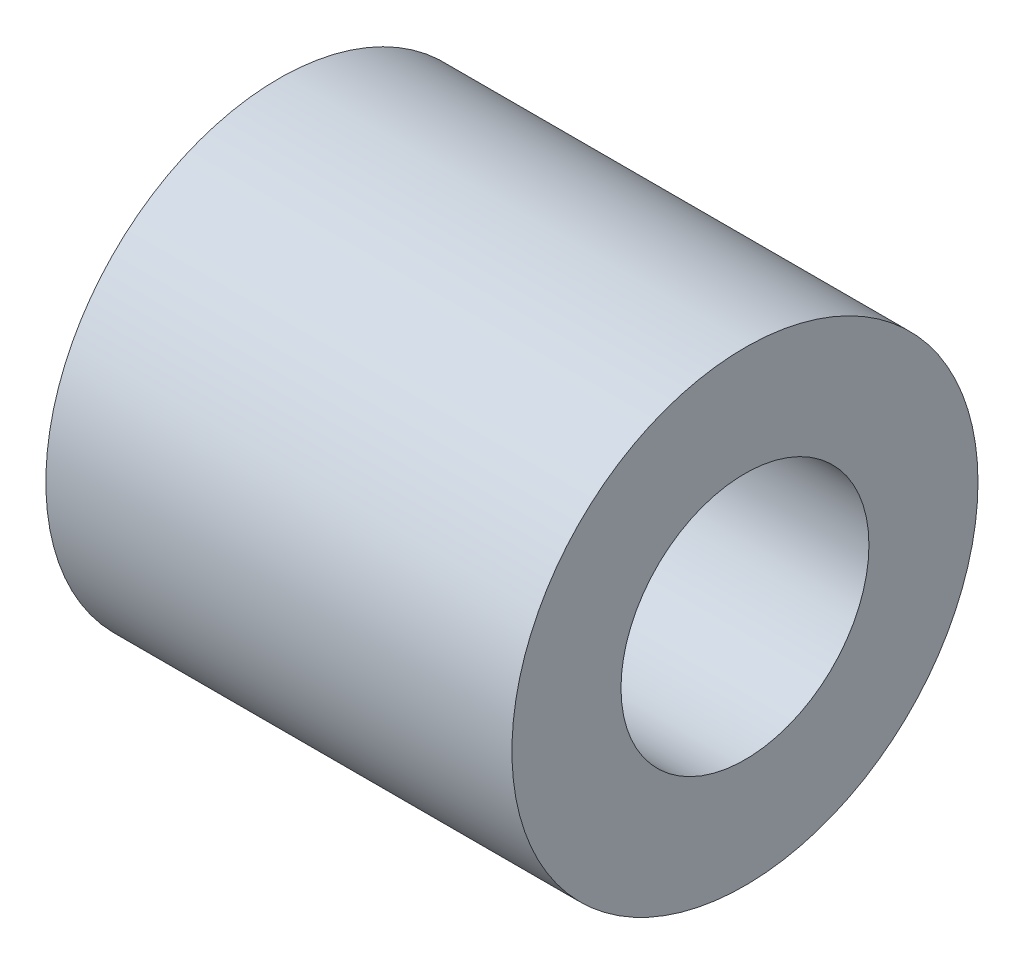
ISO-10303-21;
HEADER;
FILE_DESCRIPTION(('STEP AP214'),'2;1');
FILE_NAME('part.step','',(''),(''),'','','');
FILE_SCHEMA(('AUTOMOTIVE_DESIGN { 1 0 10303 214 1 1 1 1 }'));
ENDSEC;
DATA;
#1=APPLICATION_CONTEXT('core data for automotive mechanical design processes');
#2=APPLICATION_PROTOCOL_DEFINITION('international standard','automotive_design',2000,#1);
#3=PRODUCT_CONTEXT('',#1,'mechanical');
#4=PRODUCT('Part','Part','',(#3));
#5=PRODUCT_RELATED_PRODUCT_CATEGORY('part','',(#4));
#6=PRODUCT_DEFINITION_FORMATION('','',#4);
#7=PRODUCT_DEFINITION_CONTEXT('part definition',#1,'design');
#8=PRODUCT_DEFINITION('design','',#6,#7);
#9=PRODUCT_DEFINITION_SHAPE('','',#8);
#10=(LENGTH_UNIT() NAMED_UNIT(*) SI_UNIT(.MILLI.,.METRE.));
#11=(NAMED_UNIT(*) PLANE_ANGLE_UNIT() SI_UNIT($,.RADIAN.));
#12=(NAMED_UNIT(*) SI_UNIT($,.STERADIAN.) SOLID_ANGLE_UNIT());
#13=UNCERTAINTY_MEASURE_WITH_UNIT(LENGTH_MEASURE(1.E-05),#10,'distance_accuracy_value','');
#14=(GEOMETRIC_REPRESENTATION_CONTEXT(3) GLOBAL_UNCERTAINTY_ASSIGNED_CONTEXT((#13)) GLOBAL_UNIT_ASSIGNED_CONTEXT((#10,
#11,#12)) REPRESENTATION_CONTEXT('',''));
#15=CARTESIAN_POINT('',(0.,0.,0.));
#16=DIRECTION('',(0.,0.,1.));
#17=DIRECTION('',(1.,0.,0.));
#18=AXIS2_PLACEMENT_3D('',#15,#16,#17);
#19=CARTESIAN_POINT('',(12.7,0.,0.));
#20=DIRECTION('',(1.,0.,0.));
#21=DIRECTION('',(0.,0.,-1.));
#22=AXIS2_PLACEMENT_3D('',#19,#20,#21);
#23=PLANE('',#22);
#24=CARTESIAN_POINT('',(12.7,0.,0.));
#25=DIRECTION('',(1.,0.,0.));
#26=DIRECTION('',(0.,0.,-1.));
#27=AXIS2_PLACEMENT_3D('',#24,#25,#26);
#28=CIRCLE('',#27,6.35);
#29=CARTESIAN_POINT('',(12.7,0.,-6.35));
#30=VERTEX_POINT('',#29);
#31=EDGE_CURVE('E10',#30,#30,#28,.T.);
#32=ORIENTED_EDGE('',*,*,#31,.T.);
#33=EDGE_LOOP('',(#32));
#34=FACE_BOUND('',#33,.T.);
#35=CARTESIAN_POINT('',(12.7,0.,0.));
#36=DIRECTION('',(1.,0.,0.));
#37=DIRECTION('',(0.,0.,-1.));
#38=AXIS2_PLACEMENT_3D('',#35,#36,#37);
#39=CIRCLE('',#38,3.3782);
#40=CARTESIAN_POINT('',(12.7,0.,-3.3782));
#41=VERTEX_POINT('',#40);
#42=EDGE_CURVE('E41',#41,#41,#39,.T.);
#43=ORIENTED_EDGE('',*,*,#42,.F.);
#44=EDGE_LOOP('',(#43));
#45=FACE_BOUND('',#44,.T.);
#46=ADVANCED_FACE('F30',(#34,#45),#23,.T.);
#47=CARTESIAN_POINT('',(0.,0.,0.));
#48=DIRECTION('',(1.,0.,0.));
#49=DIRECTION('',(0.,0.,-1.));
#50=AXIS2_PLACEMENT_3D('',#47,#48,#49);
#51=PLANE('',#50);
#52=CARTESIAN_POINT('',(0.,0.,0.));
#53=DIRECTION('',(1.,0.,0.));
#54=DIRECTION('',(0.,0.,-1.));
#55=AXIS2_PLACEMENT_3D('',#52,#53,#54);
#56=CIRCLE('',#55,6.35);
#57=CARTESIAN_POINT('',(0.,0.,-6.35));
#58=VERTEX_POINT('',#57);
#59=EDGE_CURVE('E34',#58,#58,#56,.T.);
#60=ORIENTED_EDGE('',*,*,#59,.F.);
#61=EDGE_LOOP('',(#60));
#62=FACE_BOUND('',#61,.T.);
#63=CARTESIAN_POINT('',(0.,0.,0.));
#64=DIRECTION('',(1.,0.,0.));
#65=DIRECTION('',(0.,0.,-1.));
#66=AXIS2_PLACEMENT_3D('',#63,#64,#65);
#67=CIRCLE('',#66,3.3782);
#68=CARTESIAN_POINT('',(0.,0.,-3.3782));
#69=VERTEX_POINT('',#68);
#70=EDGE_CURVE('E43',#69,#69,#67,.T.);
#71=ORIENTED_EDGE('',*,*,#70,.T.);
#72=EDGE_LOOP('',(#71));
#73=FACE_BOUND('',#72,.T.);
#74=ADVANCED_FACE('F53',(#62,#73),#51,.F.);
#75=CARTESIAN_POINT('',(12.7,0.,0.));
#76=DIRECTION('',(-1.,0.,0.));
#77=DIRECTION('',(0.,0.,1.));
#78=AXIS2_PLACEMENT_3D('',#75,#76,#77);
#79=CYLINDRICAL_SURFACE('',#78,6.35);
#80=ORIENTED_EDGE('',*,*,#31,.F.);
#81=EDGE_LOOP('',(#80));
#82=FACE_BOUND('',#81,.T.);
#83=ORIENTED_EDGE('',*,*,#59,.T.);
#84=EDGE_LOOP('',(#83));
#85=FACE_BOUND('',#84,.T.);
#86=ADVANCED_FACE('F32',(#82,#85),#79,.T.);
#87=CARTESIAN_POINT('',(12.7,0.,0.));
#88=DIRECTION('',(-1.,0.,0.));
#89=DIRECTION('',(0.,0.,1.));
#90=AXIS2_PLACEMENT_3D('',#87,#88,#89);
#91=CYLINDRICAL_SURFACE('',#90,3.3782);
#92=ORIENTED_EDGE('',*,*,#42,.T.);
#93=EDGE_LOOP('',(#92));
#94=FACE_BOUND('',#93,.T.);
#95=ORIENTED_EDGE('',*,*,#70,.F.);
#96=EDGE_LOOP('',(#95));
#97=FACE_BOUND('',#96,.T.);
#98=ADVANCED_FACE('F49',(#94,#97),#91,.F.);
#99=CLOSED_SHELL('',(#46,#74,#86,#98));
#100=MANIFOLD_SOLID_BREP('B2',#99);
#101=ADVANCED_BREP_SHAPE_REPRESENTATION('',(#18,#100),#14);
#102=SHAPE_DEFINITION_REPRESENTATION(#9,#101);
ENDSEC;
END-ISO-10303-21;
